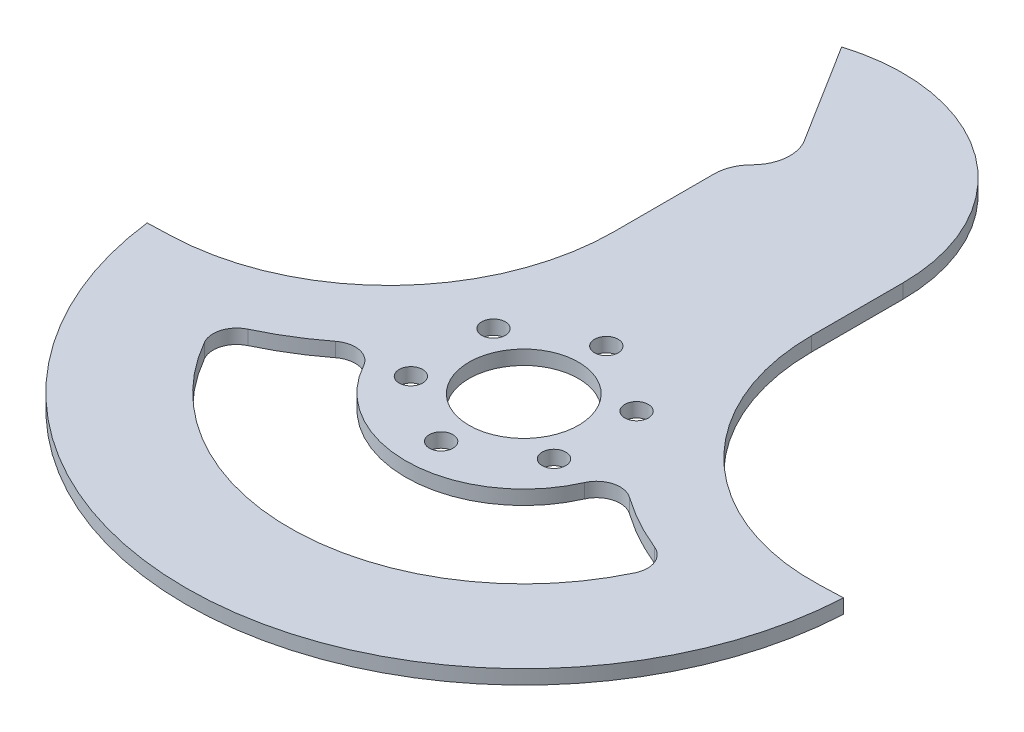
ISO-10303-21;
HEADER;
FILE_DESCRIPTION(('STEP AP214'),'2;1');
FILE_NAME('part.step','',(''),(''),'','','');
FILE_SCHEMA(('AUTOMOTIVE_DESIGN { 1 0 10303 214 1 1 1 1 }'));
ENDSEC;
DATA;
#1=APPLICATION_CONTEXT('core data for automotive mechanical design processes');
#2=APPLICATION_PROTOCOL_DEFINITION('international standard','automotive_design',2000,#1);
#3=PRODUCT_CONTEXT('',#1,'mechanical');
#4=PRODUCT('Part','Part','',(#3));
#5=PRODUCT_RELATED_PRODUCT_CATEGORY('part','',(#4));
#6=PRODUCT_DEFINITION_FORMATION('','',#4);
#7=PRODUCT_DEFINITION_CONTEXT('part definition',#1,'design');
#8=PRODUCT_DEFINITION('design','',#6,#7);
#9=PRODUCT_DEFINITION_SHAPE('','',#8);
#10=(LENGTH_UNIT() NAMED_UNIT(*) SI_UNIT(.MILLI.,.METRE.));
#11=(NAMED_UNIT(*) PLANE_ANGLE_UNIT() SI_UNIT($,.RADIAN.));
#12=(NAMED_UNIT(*) SI_UNIT($,.STERADIAN.) SOLID_ANGLE_UNIT());
#13=UNCERTAINTY_MEASURE_WITH_UNIT(LENGTH_MEASURE(1.E-05),#10,'distance_accuracy_value','');
#14=(GEOMETRIC_REPRESENTATION_CONTEXT(3) GLOBAL_UNCERTAINTY_ASSIGNED_CONTEXT((#13)) GLOBAL_UNIT_ASSIGNED_CONTEXT((#10,
#11,#12)) REPRESENTATION_CONTEXT('',''));
#15=CARTESIAN_POINT('',(0.,0.,0.));
#16=DIRECTION('',(0.,0.,1.));
#17=DIRECTION('',(1.,0.,0.));
#18=AXIS2_PLACEMENT_3D('',#15,#16,#17);
#19=CARTESIAN_POINT('',(-18.4988886877586,3.02,-60.3286115053032));
#20=DIRECTION('',(0.,-1.,0.));
#21=DIRECTION('',(0.,0.,-1.));
#22=AXIS2_PLACEMENT_3D('',#19,#20,#21);
#23=CYLINDRICAL_SURFACE('',#22,38.4988886877586);
#24=CARTESIAN_POINT('',(-18.4988886877586,0.,-60.3286115053032));
#25=DIRECTION('',(0.,1.,0.));
#26=DIRECTION('',(0.,0.,-1.));
#27=AXIS2_PLACEMENT_3D('',#24,#25,#26);
#28=CIRCLE('',#27,38.4988886877586);
#29=CARTESIAN_POINT('',(20.,0.,-60.3286115053032));
#30=VERTEX_POINT('',#29);
#31=CARTESIAN_POINT('',(-29.7853247207653,0.,-97.1359584874652));
#32=VERTEX_POINT('',#31);
#33=EDGE_CURVE('E189',#30,#32,#28,.T.);
#34=ORIENTED_EDGE('',*,*,#33,.T.);
#35=DIRECTION('',(0.,-1.,0.));
#36=VECTOR('',#35,1.);
#37=CARTESIAN_POINT('',(-29.7853247207653,3.02,-97.1359584874652));
#38=LINE('',#37,#36);
#39=CARTESIAN_POINT('',(-29.7853247207653,3.02,-97.1359584874652));
#40=VERTEX_POINT('',#39);
#41=EDGE_CURVE('E170',#40,#32,#38,.T.);
#42=ORIENTED_EDGE('',*,*,#41,.F.);
#43=CARTESIAN_POINT('',(-18.4988886877586,3.02,-60.3286115053032));
#44=DIRECTION('',(0.,1.,0.));
#45=DIRECTION('',(0.,0.,-1.));
#46=AXIS2_PLACEMENT_3D('',#43,#44,#45);
#47=CIRCLE('',#46,38.4988886877586);
#48=CARTESIAN_POINT('',(20.,3.02,-60.3286115053032));
#49=VERTEX_POINT('',#48);
#50=EDGE_CURVE('E177',#49,#40,#47,.T.);
#51=ORIENTED_EDGE('',*,*,#50,.F.);
#52=DIRECTION('',(0.,-1.,0.));
#53=VECTOR('',#52,1.);
#54=CARTESIAN_POINT('',(20.,3.02,-60.3286115053032));
#55=LINE('',#54,#53);
#56=EDGE_CURVE('E278',#49,#30,#55,.T.);
#57=ORIENTED_EDGE('',*,*,#56,.T.);
#58=EDGE_LOOP('',(#34,#42,#51,#57));
#59=FACE_BOUND('',#58,.T.);
#60=ADVANCED_FACE('F36',(#59),#23,.T.);
#61=CARTESIAN_POINT('',(-29.7853247207653,3.02,-97.1359584874652));
#62=DIRECTION('',(0.847609465178038,0.,-0.530620574931467));
#63=DIRECTION('',(-0.530620574931467,0.,-0.847609465178038));
#64=AXIS2_PLACEMENT_3D('',#61,#62,#63);
#65=PLANE('',#64);
#66=DIRECTION('',(0.530620574931467,0.,0.847609465178038));
#67=VECTOR('',#66,1.);
#68=CARTESIAN_POINT('',(-29.7853247207653,0.,-97.1359584874652));
#69=LINE('',#68,#67);
#70=CARTESIAN_POINT('',(-16.5198103474786,0.,-75.9457218580143));
#71=VERTEX_POINT('',#70);
#72=EDGE_CURVE('E280',#32,#71,#69,.T.);
#73=ORIENTED_EDGE('',*,*,#72,.T.);
#74=DIRECTION('',(0.,-1.,0.));
#75=VECTOR('',#74,1.);
#76=CARTESIAN_POINT('',(-16.5198103474786,3.02,-75.9457218580143));
#77=LINE('',#76,#75);
#78=CARTESIAN_POINT('',(-16.5198103474786,3.02,-75.9457218580143));
#79=VERTEX_POINT('',#78);
#80=EDGE_CURVE('E173',#79,#71,#77,.T.);
#81=ORIENTED_EDGE('',*,*,#80,.F.);
#82=DIRECTION('',(0.530620574931467,0.,0.847609465178038));
#83=VECTOR('',#82,1.);
#84=CARTESIAN_POINT('',(-29.7853247207653,3.02,-97.1359584874652));
#85=LINE('',#84,#83);
#86=EDGE_CURVE('E166',#40,#79,#85,.T.);
#87=ORIENTED_EDGE('',*,*,#86,.F.);
#88=ORIENTED_EDGE('',*,*,#41,.T.);
#89=EDGE_LOOP('',(#73,#81,#87,#88));
#90=FACE_BOUND('',#89,.T.);
#91=ADVANCED_FACE('F168',(#90),#65,.F.);
#92=CARTESIAN_POINT('',(-23.3261545491666,3.02,-71.684813477617));
#93=DIRECTION('',(0.,-1.,0.));
#94=DIRECTION('',(0.,0.,-1.));
#95=AXIS2_PLACEMENT_3D('',#92,#93,#94);
#96=CYLINDRICAL_SURFACE('',#95,8.03004742314711);
#97=CARTESIAN_POINT('',(-23.3261545491666,0.,-71.684813477617));
#98=DIRECTION('',(0.,-1.,0.));
#99=DIRECTION('',(0.,0.,-1.));
#100=AXIS2_PLACEMENT_3D('',#97,#98,#99);
#101=CIRCLE('',#100,8.03004742314711);
#102=CARTESIAN_POINT('',(-17.6480535630098,0.,-66.0067124914601));
#103=VERTEX_POINT('',#102);
#104=EDGE_CURVE('E282',#71,#103,#101,.T.);
#105=ORIENTED_EDGE('',*,*,#104,.T.);
#106=DIRECTION('',(0.,-1.,0.));
#107=VECTOR('',#106,1.);
#108=CARTESIAN_POINT('',(-17.6480535630098,3.02,-66.0067124914601));
#109=LINE('',#108,#107);
#110=CARTESIAN_POINT('',(-17.6480535630098,3.02,-66.0067124914601));
#111=VERTEX_POINT('',#110);
#112=EDGE_CURVE('E195',#111,#103,#109,.T.);
#113=ORIENTED_EDGE('',*,*,#112,.F.);
#114=CARTESIAN_POINT('',(-23.3261545491666,3.02,-71.684813477617));
#115=DIRECTION('',(0.,-1.,0.));
#116=DIRECTION('',(0.,0.,-1.));
#117=AXIS2_PLACEMENT_3D('',#114,#115,#116);
#118=CIRCLE('',#117,8.03004742314711);
#119=EDGE_CURVE('E176',#79,#111,#118,.T.);
#120=ORIENTED_EDGE('',*,*,#119,.F.);
#121=ORIENTED_EDGE('',*,*,#80,.T.);
#122=EDGE_LOOP('',(#105,#113,#120,#121));
#123=FACE_BOUND('',#122,.T.);
#124=ADVANCED_FACE('F344',(#123),#96,.F.);
#125=CARTESIAN_POINT('',(-11.9699525768529,3.02,-60.3286115053032));
#126=DIRECTION('',(0.,-1.,0.));
#127=DIRECTION('',(0.,0.,-1.));
#128=AXIS2_PLACEMENT_3D('',#125,#126,#127);
#129=CYLINDRICAL_SURFACE('',#128,8.03004742314711);
#130=CARTESIAN_POINT('',(-11.9699525768529,0.,-60.3286115053032));
#131=DIRECTION('',(0.,1.,0.));
#132=DIRECTION('',(0.,0.,1.));
#133=AXIS2_PLACEMENT_3D('',#130,#131,#132);
#134=CIRCLE('',#133,8.03004742314711);
#135=CARTESIAN_POINT('',(-20.,0.,-60.3286115053032));
#136=VERTEX_POINT('',#135);
#137=EDGE_CURVE('E284',#103,#136,#134,.T.);
#138=ORIENTED_EDGE('',*,*,#137,.T.);
#139=DIRECTION('',(0.,-1.,0.));
#140=VECTOR('',#139,1.);
#141=CARTESIAN_POINT('',(-20.,3.02,-60.3286115053032));
#142=LINE('',#141,#140);
#143=CARTESIAN_POINT('',(-20.,3.02,-60.3286115053032));
#144=VERTEX_POINT('',#143);
#145=EDGE_CURVE('E318',#144,#136,#142,.T.);
#146=ORIENTED_EDGE('',*,*,#145,.F.);
#147=CARTESIAN_POINT('',(-11.9699525768529,3.02,-60.3286115053032));
#148=DIRECTION('',(0.,1.,0.));
#149=DIRECTION('',(0.,0.,1.));
#150=AXIS2_PLACEMENT_3D('',#147,#148,#149);
#151=CIRCLE('',#150,8.03004742314711);
#152=EDGE_CURVE('E263',#111,#144,#151,.T.);
#153=ORIENTED_EDGE('',*,*,#152,.F.);
#154=ORIENTED_EDGE('',*,*,#112,.T.);
#155=EDGE_LOOP('',(#138,#146,#153,#154));
#156=FACE_BOUND('',#155,.T.);
#157=ADVANCED_FACE('F325',(#156),#129,.T.);
#158=CARTESIAN_POINT('',(-20.,3.02,-60.3286115053032));
#159=DIRECTION('',(1.,0.,0.));
#160=DIRECTION('',(0.,0.,-1.));
#161=AXIS2_PLACEMENT_3D('',#158,#159,#160);
#162=PLANE('',#161);
#163=DIRECTION('',(0.,0.,1.));
#164=VECTOR('',#163,1.);
#165=CARTESIAN_POINT('',(-20.,0.,-60.3286115053032));
#166=LINE('',#165,#164);
#167=CARTESIAN_POINT('',(-20.,0.,-39.1548612912108));
#168=VERTEX_POINT('',#167);
#169=EDGE_CURVE('E286',#136,#168,#166,.T.);
#170=ORIENTED_EDGE('',*,*,#169,.T.);
#171=DIRECTION('',(0.,-1.,0.));
#172=VECTOR('',#171,1.);
#173=CARTESIAN_POINT('',(-20.,3.02,-39.1548612912108));
#174=LINE('',#173,#172);
#175=CARTESIAN_POINT('',(-20.,3.02,-39.1548612912108));
#176=VERTEX_POINT('',#175);
#177=EDGE_CURVE('E315',#176,#168,#174,.T.);
#178=ORIENTED_EDGE('',*,*,#177,.F.);
#179=DIRECTION('',(0.,0.,1.));
#180=VECTOR('',#179,1.);
#181=CARTESIAN_POINT('',(-20.,3.02,-60.3286115053032));
#182=LINE('',#181,#180);
#183=EDGE_CURVE('E265',#144,#176,#182,.T.);
#184=ORIENTED_EDGE('',*,*,#183,.F.);
#185=ORIENTED_EDGE('',*,*,#145,.T.);
#186=EDGE_LOOP('',(#170,#178,#184,#185));
#187=FACE_BOUND('',#186,.T.);
#188=ADVANCED_FACE('F336',(#187),#162,.F.);
#189=CARTESIAN_POINT('',(-67.7352878430961,3.02,-39.1548612912108));
#190=DIRECTION('',(0.,-1.,0.));
#191=DIRECTION('',(0.,0.,-1.));
#192=AXIS2_PLACEMENT_3D('',#189,#190,#191);
#193=CYLINDRICAL_SURFACE('',#192,47.7352878430961);
#194=CARTESIAN_POINT('',(-67.7352878430961,0.,-39.1548612912108));
#195=DIRECTION('',(0.,-1.,0.));
#196=DIRECTION('',(0.,0.,1.));
#197=AXIS2_PLACEMENT_3D('',#194,#195,#196);
#198=CIRCLE('',#197,47.7352878430961);
#199=CARTESIAN_POINT('',(-66.0693503224232,0.,8.5513475042956));
#200=VERTEX_POINT('',#199);
#201=EDGE_CURVE('E288',#168,#200,#198,.T.);
#202=ORIENTED_EDGE('',*,*,#201,.T.);
#203=DIRECTION('',(0.,-1.,0.));
#204=VECTOR('',#203,1.);
#205=CARTESIAN_POINT('',(-66.0693503224232,3.02,8.5513475042956));
#206=LINE('',#205,#204);
#207=CARTESIAN_POINT('',(-66.0693503224232,3.02,8.5513475042956));
#208=VERTEX_POINT('',#207);
#209=EDGE_CURVE('E312',#208,#200,#206,.T.);
#210=ORIENTED_EDGE('',*,*,#209,.F.);
#211=CARTESIAN_POINT('',(-67.7352878430961,3.02,-39.1548612912108));
#212=DIRECTION('',(0.,-1.,0.));
#213=DIRECTION('',(0.,0.,1.));
#214=AXIS2_PLACEMENT_3D('',#211,#212,#213);
#215=CIRCLE('',#214,47.7352878430961);
#216=EDGE_CURVE('E267',#176,#208,#215,.T.);
#217=ORIENTED_EDGE('',*,*,#216,.F.);
#218=ORIENTED_EDGE('',*,*,#177,.T.);
#219=EDGE_LOOP('',(#202,#210,#217,#218));
#220=FACE_BOUND('',#219,.T.);
#221=ADVANCED_FACE('F340',(#220),#193,.F.);
#222=CARTESIAN_POINT('',(-71.0663044575187,3.02,8.72584498780808));
#223=DIRECTION('',(0.0348994967024969,0.,0.999390827019096));
#224=DIRECTION('',(0.999390827019096,0.,-0.0348994967024969));
#225=AXIS2_PLACEMENT_3D('',#222,#223,#224);
#226=PLANE('',#225);
#227=DIRECTION('',(-0.999390827019096,0.,0.0348994967024969));
#228=VECTOR('',#227,1.);
#229=CARTESIAN_POINT('',(-71.0663044575187,0.,8.72584498780808));
#230=LINE('',#229,#228);
#231=CARTESIAN_POINT('',(-71.0663044575187,0.,8.72584498780808));
#232=VERTEX_POINT('',#231);
#233=EDGE_CURVE('E290',#200,#232,#230,.T.);
#234=ORIENTED_EDGE('',*,*,#233,.T.);
#235=DIRECTION('',(0.,-1.,0.));
#236=VECTOR('',#235,1.);
#237=CARTESIAN_POINT('',(-71.0663044575187,3.02,8.72584498780808));
#238=LINE('',#237,#236);
#239=CARTESIAN_POINT('',(-71.0663044575187,3.02,8.72584498780808));
#240=VERTEX_POINT('',#239);
#241=EDGE_CURVE('E309',#240,#232,#238,.T.);
#242=ORIENTED_EDGE('',*,*,#241,.F.);
#243=DIRECTION('',(-0.999390827019096,0.,0.0348994967024969));
#244=VECTOR('',#243,1.);
#245=CARTESIAN_POINT('',(-71.0663044575187,3.02,8.72584498780808));
#246=LINE('',#245,#244);
#247=EDGE_CURVE('E269',#208,#240,#246,.T.);
#248=ORIENTED_EDGE('',*,*,#247,.F.);
#249=ORIENTED_EDGE('',*,*,#209,.T.);
#250=EDGE_LOOP('',(#234,#242,#248,#249));
#251=FACE_BOUND('',#250,.T.);
#252=ADVANCED_FACE('F415',(#251),#226,.F.);
#253=CARTESIAN_POINT('',(0.,3.02,0.));
#254=DIRECTION('',(0.,-1.,0.));
#255=DIRECTION('',(0.,0.,-1.));
#256=AXIS2_PLACEMENT_3D('',#253,#254,#255);
#257=CYLINDRICAL_SURFACE('',#256,71.6);
#258=CARTESIAN_POINT('',(0.,0.,0.));
#259=DIRECTION('',(0.,1.,0.));
#260=DIRECTION('',(0.,0.,1.));
#261=AXIS2_PLACEMENT_3D('',#258,#259,#260);
#262=CIRCLE('',#261,71.6);
#263=CARTESIAN_POINT('',(71.5018746884275,0.,3.74725446699478));
#264=VERTEX_POINT('',#263);
#265=EDGE_CURVE('E292',#232,#264,#262,.T.);
#266=ORIENTED_EDGE('',*,*,#265,.T.);
#267=DIRECTION('',(0.,-1.,0.));
#268=VECTOR('',#267,1.);
#269=CARTESIAN_POINT('',(71.5018746884275,3.02,3.74725446699478));
#270=LINE('',#269,#268);
#271=CARTESIAN_POINT('',(71.5018746884275,3.02,3.74725446699478));
#272=VERTEX_POINT('',#271);
#273=EDGE_CURVE('E306',#272,#264,#270,.T.);
#274=ORIENTED_EDGE('',*,*,#273,.F.);
#275=CARTESIAN_POINT('',(0.,3.02,0.));
#276=DIRECTION('',(0.,1.,0.));
#277=DIRECTION('',(0.,0.,1.));
#278=AXIS2_PLACEMENT_3D('',#275,#276,#277);
#279=CIRCLE('',#278,71.6);
#280=EDGE_CURVE('E271',#240,#272,#279,.T.);
#281=ORIENTED_EDGE('',*,*,#280,.F.);
#282=ORIENTED_EDGE('',*,*,#241,.T.);
#283=EDGE_LOOP('',(#266,#274,#281,#282));
#284=FACE_BOUND('',#283,.T.);
#285=ADVANCED_FACE('F411',(#284),#257,.T.);
#286=CARTESIAN_POINT('',(71.5018746884275,3.02,3.74725446699479));
#287=DIRECTION('',(0.0348994967024994,0.,0.999390827019096));
#288=DIRECTION('',(0.999390827019096,0.,-0.0348994967024994));
#289=AXIS2_PLACEMENT_3D('',#286,#287,#288);
#290=PLANE('',#289);
#291=DIRECTION('',(-0.999390827019096,0.,0.0348994967024994));
#292=VECTOR('',#291,1.);
#293=CARTESIAN_POINT('',(71.5018746884275,0.,3.74725446699479));
#294=LINE('',#293,#292);
#295=CARTESIAN_POINT('',(66.504920553332,0.,3.92175195050728));
#296=VERTEX_POINT('',#295);
#297=EDGE_CURVE('E294',#264,#296,#294,.T.);
#298=ORIENTED_EDGE('',*,*,#297,.T.);
#299=DIRECTION('',(0.,-1.,0.));
#300=VECTOR('',#299,1.);
#301=CARTESIAN_POINT('',(66.504920553332,3.02,3.92175195050728));
#302=LINE('',#301,#300);
#303=CARTESIAN_POINT('',(66.504920553332,3.02,3.92175195050728));
#304=VERTEX_POINT('',#303);
#305=EDGE_CURVE('E303',#304,#296,#302,.T.);
#306=ORIENTED_EDGE('',*,*,#305,.F.);
#307=DIRECTION('',(-0.999390827019096,0.,0.0348994967024994));
#308=VECTOR('',#307,1.);
#309=CARTESIAN_POINT('',(71.5018746884275,3.02,3.74725446699479));
#310=LINE('',#309,#308);
#311=EDGE_CURVE('E273',#272,#304,#310,.T.);
#312=ORIENTED_EDGE('',*,*,#311,.F.);
#313=ORIENTED_EDGE('',*,*,#273,.T.);
#314=EDGE_LOOP('',(#298,#306,#312,#313));
#315=FACE_BOUND('',#314,.T.);
#316=ADVANCED_FACE('F407',(#315),#290,.F.);
#317=CARTESIAN_POINT('',(64.9366539470845,3.02,-40.9875278011404));
#318=DIRECTION('',(0.,-1.,0.));
#319=DIRECTION('',(0.,0.,-1.));
#320=AXIS2_PLACEMENT_3D('',#317,#318,#319);
#321=CYLINDRICAL_SURFACE('',#320,44.9366539470845);
#322=CARTESIAN_POINT('',(64.9366539470845,0.,-40.9875278011404));
#323=DIRECTION('',(0.,-1.,0.));
#324=DIRECTION('',(0.,0.,1.));
#325=AXIS2_PLACEMENT_3D('',#322,#323,#324);
#326=CIRCLE('',#325,44.9366539470845);
#327=CARTESIAN_POINT('',(20.,0.,-40.9875278011404));
#328=VERTEX_POINT('',#327);
#329=EDGE_CURVE('E296',#296,#328,#326,.T.);
#330=ORIENTED_EDGE('',*,*,#329,.T.);
#331=DIRECTION('',(0.,-1.,0.));
#332=VECTOR('',#331,1.);
#333=CARTESIAN_POINT('',(20.,3.02,-40.9875278011404));
#334=LINE('',#333,#332);
#335=CARTESIAN_POINT('',(20.,3.02,-40.9875278011404));
#336=VERTEX_POINT('',#335);
#337=EDGE_CURVE('E300',#336,#328,#334,.T.);
#338=ORIENTED_EDGE('',*,*,#337,.F.);
#339=CARTESIAN_POINT('',(64.9366539470845,3.02,-40.9875278011404));
#340=DIRECTION('',(0.,-1.,0.));
#341=DIRECTION('',(0.,0.,1.));
#342=AXIS2_PLACEMENT_3D('',#339,#340,#341);
#343=CIRCLE('',#342,44.9366539470845);
#344=EDGE_CURVE('E275',#304,#336,#343,.T.);
#345=ORIENTED_EDGE('',*,*,#344,.F.);
#346=ORIENTED_EDGE('',*,*,#305,.T.);
#347=EDGE_LOOP('',(#330,#338,#345,#346));
#348=FACE_BOUND('',#347,.T.);
#349=ADVANCED_FACE('F403',(#348),#321,.F.);
#350=CARTESIAN_POINT('',(20.,3.02,-60.3286115053032));
#351=DIRECTION('',(-1.,0.,0.));
#352=DIRECTION('',(0.,0.,1.));
#353=AXIS2_PLACEMENT_3D('',#350,#351,#352);
#354=PLANE('',#353);
#355=DIRECTION('',(0.,0.,-1.));
#356=VECTOR('',#355,1.);
#357=CARTESIAN_POINT('',(20.,0.,-60.3286115053032));
#358=LINE('',#357,#356);
#359=EDGE_CURVE('E186',#328,#30,#358,.T.);
#360=ORIENTED_EDGE('',*,*,#359,.T.);
#361=ORIENTED_EDGE('',*,*,#56,.F.);
#362=DIRECTION('',(0.,0.,-1.));
#363=VECTOR('',#362,1.);
#364=CARTESIAN_POINT('',(20.,3.02,-60.3286115053032));
#365=LINE('',#364,#363);
#366=EDGE_CURVE('E182',#336,#49,#365,.T.);
#367=ORIENTED_EDGE('',*,*,#366,.F.);
#368=ORIENTED_EDGE('',*,*,#337,.T.);
#369=EDGE_LOOP('',(#360,#361,#367,#368));
#370=FACE_BOUND('',#369,.T.);
#371=ADVANCED_FACE('F395',(#370),#354,.F.);
#372=CARTESIAN_POINT('',(-18.4988886877586,3.02,-60.3286115053032));
#373=DIRECTION('',(0.,-1.,0.));
#374=DIRECTION('',(0.,0.,-1.));
#375=AXIS2_PLACEMENT_3D('',#372,#373,#374);
#376=PLANE('',#375);
#377=CARTESIAN_POINT('',(0.168160546794866,3.02,17.6725596259594));
#378=DIRECTION('',(0.,1.,0.));
#379=DIRECTION('',(0.,0.,1.));
#380=AXIS2_PLACEMENT_3D('',#377,#378,#379);
#381=CIRCLE('',#380,2.5);
#382=CARTESIAN_POINT('',(0.168160546794866,3.02,20.1725596259594));
#383=VERTEX_POINT('',#382);
#384=EDGE_CURVE('E632',#383,#383,#381,.T.);
#385=ORIENTED_EDGE('',*,*,#384,.F.);
#386=EDGE_LOOP('',(#385));
#387=FACE_BOUND('',#386,.T.);
#388=CARTESIAN_POINT('',(15.3236051130226,3.02,8.92255962595941));
#389=DIRECTION('',(0.,1.,0.));
#390=DIRECTION('',(0.,0.,1.));
#391=AXIS2_PLACEMENT_3D('',#388,#389,#390);
#392=CIRCLE('',#391,2.5);
#393=CARTESIAN_POINT('',(15.3236051130226,3.02,11.4225596259594));
#394=VERTEX_POINT('',#393);
#395=EDGE_CURVE('E660',#394,#394,#392,.T.);
#396=ORIENTED_EDGE('',*,*,#395,.F.);
#397=EDGE_LOOP('',(#396));
#398=FACE_BOUND('',#397,.T.);
#399=CARTESIAN_POINT('',(15.3236051130225,3.02,-8.57744037404059));
#400=DIRECTION('',(0.,1.,0.));
#401=DIRECTION('',(0.,0.,1.));
#402=AXIS2_PLACEMENT_3D('',#399,#400,#401);
#403=CIRCLE('',#402,2.5);
#404=CARTESIAN_POINT('',(15.3236051130225,3.02,-6.07744037404058));
#405=VERTEX_POINT('',#404);
#406=EDGE_CURVE('E635',#405,#405,#403,.T.);
#407=ORIENTED_EDGE('',*,*,#406,.F.);
#408=EDGE_LOOP('',(#407));
#409=FACE_BOUND('',#408,.T.);
#410=CARTESIAN_POINT('',(0.168160546794866,3.02,-17.3274403740406));
#411=DIRECTION('',(0.,1.,0.));
#412=DIRECTION('',(0.,0.,1.));
#413=AXIS2_PLACEMENT_3D('',#410,#411,#412);
#414=CIRCLE('',#413,2.5);
#415=CARTESIAN_POINT('',(0.168160546794866,3.02,-14.8274403740406));
#416=VERTEX_POINT('',#415);
#417=EDGE_CURVE('E642',#416,#416,#414,.T.);
#418=ORIENTED_EDGE('',*,*,#417,.F.);
#419=EDGE_LOOP('',(#418));
#420=FACE_BOUND('',#419,.T.);
#421=CARTESIAN_POINT('',(-14.9872840194328,3.02,-8.57744037404058));
#422=DIRECTION('',(0.,1.,0.));
#423=DIRECTION('',(0.,0.,1.));
#424=AXIS2_PLACEMENT_3D('',#421,#422,#423);
#425=CIRCLE('',#424,2.5);
#426=CARTESIAN_POINT('',(-14.9872840194328,3.02,-6.07744037404057));
#427=VERTEX_POINT('',#426);
#428=EDGE_CURVE('E648',#427,#427,#425,.T.);
#429=ORIENTED_EDGE('',*,*,#428,.F.);
#430=EDGE_LOOP('',(#429));
#431=FACE_BOUND('',#430,.T.);
#432=CARTESIAN_POINT('',(-14.9872840194328,3.02,8.92255962595942));
#433=DIRECTION('',(0.,1.,0.));
#434=DIRECTION('',(0.,0.,1.));
#435=AXIS2_PLACEMENT_3D('',#432,#433,#434);
#436=CIRCLE('',#435,2.5);
#437=CARTESIAN_POINT('',(-14.9872840194328,3.02,11.4225596259594));
#438=VERTEX_POINT('',#437);
#439=EDGE_CURVE('E654',#438,#438,#436,.T.);
#440=ORIENTED_EDGE('',*,*,#439,.F.);
#441=EDGE_LOOP('',(#440));
#442=FACE_BOUND('',#441,.T.);
#443=CARTESIAN_POINT('',(0.168160546794866,3.02,0.172559625959421));
#444=DIRECTION('',(0.,1.,0.));
#445=DIRECTION('',(0.,0.,1.));
#446=AXIS2_PLACEMENT_3D('',#443,#444,#445);
#447=CIRCLE('',#446,11.6);
#448=CARTESIAN_POINT('',(0.168160546794866,3.02,11.7725596259594));
#449=VERTEX_POINT('',#448);
#450=EDGE_CURVE('E627',#449,#449,#447,.T.);
#451=ORIENTED_EDGE('',*,*,#450,.F.);
#452=EDGE_LOOP('',(#451));
#453=FACE_BOUND('',#452,.T.);
#454=CARTESIAN_POINT('',(-67.7352878430961,3.02,-39.1548612912108));
#455=DIRECTION('',(0.,-1.,0.));
#456=DIRECTION('',(0.,0.,-1.));
#457=AXIS2_PLACEMENT_3D('',#454,#455,#456);
#458=CIRCLE('',#457,62.7352878430961);
#459=CARTESIAN_POINT('',(-29.360174511927,3.02,10.4744346697037));
#460=VERTEX_POINT('',#459);
#461=CARTESIAN_POINT('',(-40.8963295212605,3.02,17.5495182306118));
#462=VERTEX_POINT('',#461);
#463=EDGE_CURVE('E233',#460,#462,#458,.T.);
#464=ORIENTED_EDGE('',*,*,#463,.F.);
#465=CARTESIAN_POINT('',(-26.3016794726481,3.02,14.4298876266615));
#466=DIRECTION('',(0.,-1.,0.));
#467=DIRECTION('',(0.,0.,-1.));
#468=AXIS2_PLACEMENT_3D('',#465,#466,#467);
#469=CIRCLE('',#468,5.);
#470=CARTESIAN_POINT('',(-21.9180662272067,3.02,12.0249063555513));
#471=VERTEX_POINT('',#470);
#472=EDGE_CURVE('E44',#460,#471,#469,.T.);
#473=ORIENTED_EDGE('',*,*,#472,.T.);
#474=CARTESIAN_POINT('',(0.,3.02,0.));
#475=DIRECTION('',(0.,1.,0.));
#476=DIRECTION('',(0.,0.,1.));
#477=AXIS2_PLACEMENT_3D('',#474,#475,#476);
#478=CIRCLE('',#477,25.);
#479=CARTESIAN_POINT('',(22.89383918866,3.02,10.0435116968007));
#480=VERTEX_POINT('',#479);
#481=EDGE_CURVE('E231',#471,#480,#478,.T.);
#482=ORIENTED_EDGE('',*,*,#481,.T.);
#483=CARTESIAN_POINT('',(27.472607026392,3.02,12.0522140361608));
#484=DIRECTION('',(0.,-1.,0.));
#485=DIRECTION('',(0.,0.,-1.));
#486=AXIS2_PLACEMENT_3D('',#483,#484,#485);
#487=CIRCLE('',#486,5.);
#488=CARTESIAN_POINT('',(30.3572680493654,3.02,7.96825385240064));
#489=VERTEX_POINT('',#488);
#490=EDGE_CURVE('E226',#480,#489,#487,.T.);
#491=ORIENTED_EDGE('',*,*,#490,.T.);
#492=CARTESIAN_POINT('',(64.9366539470845,3.02,-40.9875278011404));
#493=DIRECTION('',(0.,-1.,0.));
#494=DIRECTION('',(0.,0.,1.));
#495=AXIS2_PLACEMENT_3D('',#492,#493,#494);
#496=CIRCLE('',#495,59.9366539470845);
#497=CARTESIAN_POINT('',(42.2016225398616,3.02,14.4698507276465));
#498=VERTEX_POINT('',#497);
#499=EDGE_CURVE('E247',#498,#489,#496,.T.);
#500=ORIENTED_EDGE('',*,*,#499,.F.);
#501=CARTESIAN_POINT('',(40.3050342328722,3.02,19.0961832701461));
#502=DIRECTION('',(0.,-1.,0.));
#503=DIRECTION('',(0.,0.,-1.));
#504=AXIS2_PLACEMENT_3D('',#501,#502,#503);
#505=CIRCLE('',#504,5.);
#506=CARTESIAN_POINT('',(44.8235358284856,3.02,21.2370109910145));
#507=VERTEX_POINT('',#506);
#508=EDGE_CURVE('E206',#498,#507,#505,.T.);
#509=ORIENTED_EDGE('',*,*,#508,.T.);
#510=CARTESIAN_POINT('',(0.,3.02,0.));
#511=DIRECTION('',(0.,1.,0.));
#512=DIRECTION('',(0.,0.,1.));
#513=AXIS2_PLACEMENT_3D('',#510,#511,#512);
#514=CIRCLE('',#513,49.6000000000001);
#515=CARTESIAN_POINT('',(-43.1022505186581,3.02,24.5429419635634));
#516=VERTEX_POINT('',#515);
#517=EDGE_CURVE('E253',#516,#507,#514,.T.);
#518=ORIENTED_EDGE('',*,*,#517,.F.);
#519=CARTESIAN_POINT('',(-38.7572655873418,3.02,22.0688550720751));
#520=DIRECTION('',(0.,-1.,0.));
#521=DIRECTION('',(0.,0.,-1.));
#522=AXIS2_PLACEMENT_3D('',#519,#520,#521);
#523=CIRCLE('',#522,5.);
#524=EDGE_CURVE('E210',#516,#462,#523,.T.);
#525=ORIENTED_EDGE('',*,*,#524,.T.);
#526=EDGE_LOOP('',(#464,#473,#482,#491,#500,#509,#518,#525));
#527=FACE_BOUND('',#526,.T.);
#528=ORIENTED_EDGE('',*,*,#50,.T.);
#529=ORIENTED_EDGE('',*,*,#86,.T.);
#530=ORIENTED_EDGE('',*,*,#119,.T.);
#531=ORIENTED_EDGE('',*,*,#152,.T.);
#532=ORIENTED_EDGE('',*,*,#183,.T.);
#533=ORIENTED_EDGE('',*,*,#216,.T.);
#534=ORIENTED_EDGE('',*,*,#247,.T.);
#535=ORIENTED_EDGE('',*,*,#280,.T.);
#536=ORIENTED_EDGE('',*,*,#311,.T.);
#537=ORIENTED_EDGE('',*,*,#344,.T.);
#538=ORIENTED_EDGE('',*,*,#366,.T.);
#539=EDGE_LOOP('',(#528,#529,#530,#531,#532,#533,#534,#535,#536,#537,#538));
#540=FACE_BOUND('',#539,.T.);
#541=ADVANCED_FACE('F180',(#387,#398,#409,#420,#431,#442,#453,#527,#540),#376,.F.);
#542=CARTESIAN_POINT('',(-18.4988886877586,0.,-60.3286115053032));
#543=DIRECTION('',(0.,-1.,0.));
#544=DIRECTION('',(0.,0.,-1.));
#545=AXIS2_PLACEMENT_3D('',#542,#543,#544);
#546=PLANE('',#545);
#547=CARTESIAN_POINT('',(0.168160546794866,0.,17.6725596259594));
#548=DIRECTION('',(0.,1.,0.));
#549=DIRECTION('',(0.,0.,1.));
#550=AXIS2_PLACEMENT_3D('',#547,#548,#549);
#551=CIRCLE('',#550,2.5);
#552=CARTESIAN_POINT('',(0.168160546794866,0.,20.1725596259594));
#553=VERTEX_POINT('',#552);
#554=EDGE_CURVE('E629',#553,#553,#551,.T.);
#555=ORIENTED_EDGE('',*,*,#554,.T.);
#556=EDGE_LOOP('',(#555));
#557=FACE_BOUND('',#556,.T.);
#558=CARTESIAN_POINT('',(15.3236051130226,0.,8.92255962595941));
#559=DIRECTION('',(0.,1.,0.));
#560=DIRECTION('',(0.,0.,1.));
#561=AXIS2_PLACEMENT_3D('',#558,#559,#560);
#562=CIRCLE('',#561,2.5);
#563=CARTESIAN_POINT('',(15.3236051130226,0.,11.4225596259594));
#564=VERTEX_POINT('',#563);
#565=EDGE_CURVE('E639',#564,#564,#562,.T.);
#566=ORIENTED_EDGE('',*,*,#565,.T.);
#567=EDGE_LOOP('',(#566));
#568=FACE_BOUND('',#567,.T.);
#569=CARTESIAN_POINT('',(15.3236051130225,0.,-8.57744037404059));
#570=DIRECTION('',(0.,1.,0.));
#571=DIRECTION('',(0.,0.,1.));
#572=AXIS2_PLACEMENT_3D('',#569,#570,#571);
#573=CIRCLE('',#572,2.5);
#574=CARTESIAN_POINT('',(15.3236051130225,0.,-6.07744037404058));
#575=VERTEX_POINT('',#574);
#576=EDGE_CURVE('E638',#575,#575,#573,.T.);
#577=ORIENTED_EDGE('',*,*,#576,.T.);
#578=EDGE_LOOP('',(#577));
#579=FACE_BOUND('',#578,.T.);
#580=CARTESIAN_POINT('',(0.168160546794866,0.,-17.3274403740406));
#581=DIRECTION('',(0.,1.,0.));
#582=DIRECTION('',(0.,0.,1.));
#583=AXIS2_PLACEMENT_3D('',#580,#581,#582);
#584=CIRCLE('',#583,2.5);
#585=CARTESIAN_POINT('',(0.168160546794866,0.,-14.8274403740406));
#586=VERTEX_POINT('',#585);
#587=EDGE_CURVE('E645',#586,#586,#584,.T.);
#588=ORIENTED_EDGE('',*,*,#587,.T.);
#589=EDGE_LOOP('',(#588));
#590=FACE_BOUND('',#589,.T.);
#591=CARTESIAN_POINT('',(-14.9872840194328,0.,-8.57744037404058));
#592=DIRECTION('',(0.,1.,0.));
#593=DIRECTION('',(0.,0.,1.));
#594=AXIS2_PLACEMENT_3D('',#591,#592,#593);
#595=CIRCLE('',#594,2.5);
#596=CARTESIAN_POINT('',(-14.9872840194328,0.,-6.07744037404057));
#597=VERTEX_POINT('',#596);
#598=EDGE_CURVE('E651',#597,#597,#595,.T.);
#599=ORIENTED_EDGE('',*,*,#598,.T.);
#600=EDGE_LOOP('',(#599));
#601=FACE_BOUND('',#600,.T.);
#602=CARTESIAN_POINT('',(-14.9872840194328,0.,8.92255962595942));
#603=DIRECTION('',(0.,1.,0.));
#604=DIRECTION('',(0.,0.,1.));
#605=AXIS2_PLACEMENT_3D('',#602,#603,#604);
#606=CIRCLE('',#605,2.5);
#607=CARTESIAN_POINT('',(-14.9872840194328,0.,11.4225596259594));
#608=VERTEX_POINT('',#607);
#609=EDGE_CURVE('E657',#608,#608,#606,.T.);
#610=ORIENTED_EDGE('',*,*,#609,.T.);
#611=EDGE_LOOP('',(#610));
#612=FACE_BOUND('',#611,.T.);
#613=CARTESIAN_POINT('',(0.168160546794866,0.,0.172559625959421));
#614=DIRECTION('',(0.,1.,0.));
#615=DIRECTION('',(0.,0.,1.));
#616=AXIS2_PLACEMENT_3D('',#613,#614,#615);
#617=CIRCLE('',#616,11.6);
#618=CARTESIAN_POINT('',(0.168160546794866,0.,11.7725596259594));
#619=VERTEX_POINT('',#618);
#620=EDGE_CURVE('E239',#619,#619,#617,.T.);
#621=ORIENTED_EDGE('',*,*,#620,.T.);
#622=EDGE_LOOP('',(#621));
#623=FACE_BOUND('',#622,.T.);
#624=CARTESIAN_POINT('',(64.9366539470845,0.,-40.9875278011404));
#625=DIRECTION('',(0.,-1.,0.));
#626=DIRECTION('',(0.,0.,1.));
#627=AXIS2_PLACEMENT_3D('',#624,#625,#626);
#628=CIRCLE('',#627,59.9366539470845);
#629=CARTESIAN_POINT('',(42.2016225398616,0.,14.4698507276465));
#630=VERTEX_POINT('',#629);
#631=CARTESIAN_POINT('',(30.3572680493654,0.,7.96825385240064));
#632=VERTEX_POINT('',#631);
#633=EDGE_CURVE('E250',#630,#632,#628,.T.);
#634=ORIENTED_EDGE('',*,*,#633,.T.);
#635=CARTESIAN_POINT('',(27.472607026392,0.,12.0522140361608));
#636=DIRECTION('',(0.,-1.,0.));
#637=DIRECTION('',(0.,0.,-1.));
#638=AXIS2_PLACEMENT_3D('',#635,#636,#637);
#639=CIRCLE('',#638,5.);
#640=CARTESIAN_POINT('',(22.89383918866,0.,10.0435116968007));
#641=VERTEX_POINT('',#640);
#642=EDGE_CURVE('E224',#632,#641,#639,.F.);
#643=ORIENTED_EDGE('',*,*,#642,.T.);
#644=CARTESIAN_POINT('',(0.,0.,0.));
#645=DIRECTION('',(0.,-1.,0.));
#646=DIRECTION('',(0.,0.,-1.));
#647=AXIS2_PLACEMENT_3D('',#644,#645,#646);
#648=CIRCLE('',#647,25.);
#649=CARTESIAN_POINT('',(-21.9180662272067,0.,12.0249063555513));
#650=VERTEX_POINT('',#649);
#651=EDGE_CURVE('E238',#650,#641,#648,.F.);
#652=ORIENTED_EDGE('',*,*,#651,.F.);
#653=CARTESIAN_POINT('',(-26.3016794726481,0.,14.4298876266615));
#654=DIRECTION('',(0.,-1.,0.));
#655=DIRECTION('',(0.,0.,-1.));
#656=AXIS2_PLACEMENT_3D('',#653,#654,#655);
#657=CIRCLE('',#656,5.);
#658=CARTESIAN_POINT('',(-29.360174511927,0.,10.4744346697037));
#659=VERTEX_POINT('',#658);
#660=EDGE_CURVE('E11',#650,#659,#657,.F.);
#661=ORIENTED_EDGE('',*,*,#660,.T.);
#662=CARTESIAN_POINT('',(-67.7352878430961,0.,-39.1548612912108));
#663=DIRECTION('',(0.,-1.,0.));
#664=DIRECTION('',(0.,0.,-1.));
#665=AXIS2_PLACEMENT_3D('',#662,#663,#664);
#666=CIRCLE('',#665,62.7352878430961);
#667=CARTESIAN_POINT('',(-40.8963295212605,0.,17.5495182306118));
#668=VERTEX_POINT('',#667);
#669=EDGE_CURVE('E243',#659,#668,#666,.T.);
#670=ORIENTED_EDGE('',*,*,#669,.T.);
#671=CARTESIAN_POINT('',(-38.7572655873418,0.,22.0688550720751));
#672=DIRECTION('',(0.,-1.,0.));
#673=DIRECTION('',(0.,0.,-1.));
#674=AXIS2_PLACEMENT_3D('',#671,#672,#673);
#675=CIRCLE('',#674,5.);
#676=CARTESIAN_POINT('',(-43.1022505186581,0.,24.5429419635634));
#677=VERTEX_POINT('',#676);
#678=EDGE_CURVE('E213',#668,#677,#675,.F.);
#679=ORIENTED_EDGE('',*,*,#678,.T.);
#680=CARTESIAN_POINT('',(0.,0.,0.));
#681=DIRECTION('',(0.,1.,0.));
#682=DIRECTION('',(0.,0.,1.));
#683=AXIS2_PLACEMENT_3D('',#680,#681,#682);
#684=CIRCLE('',#683,49.6000000000001);
#685=CARTESIAN_POINT('',(44.8235358284856,0.,21.2370109910145));
#686=VERTEX_POINT('',#685);
#687=EDGE_CURVE('E246',#677,#686,#684,.T.);
#688=ORIENTED_EDGE('',*,*,#687,.T.);
#689=CARTESIAN_POINT('',(40.3050342328722,0.,19.0961832701461));
#690=DIRECTION('',(0.,-1.,0.));
#691=DIRECTION('',(0.,0.,-1.));
#692=AXIS2_PLACEMENT_3D('',#689,#690,#691);
#693=CIRCLE('',#692,5.);
#694=EDGE_CURVE('E208',#686,#630,#693,.F.);
#695=ORIENTED_EDGE('',*,*,#694,.T.);
#696=EDGE_LOOP('',(#634,#643,#652,#661,#670,#679,#688,#695));
#697=FACE_BOUND('',#696,.T.);
#698=ORIENTED_EDGE('',*,*,#33,.F.);
#699=ORIENTED_EDGE('',*,*,#359,.F.);
#700=ORIENTED_EDGE('',*,*,#329,.F.);
#701=ORIENTED_EDGE('',*,*,#297,.F.);
#702=ORIENTED_EDGE('',*,*,#265,.F.);
#703=ORIENTED_EDGE('',*,*,#233,.F.);
#704=ORIENTED_EDGE('',*,*,#201,.F.);
#705=ORIENTED_EDGE('',*,*,#169,.F.);
#706=ORIENTED_EDGE('',*,*,#137,.F.);
#707=ORIENTED_EDGE('',*,*,#104,.F.);
#708=ORIENTED_EDGE('',*,*,#72,.F.);
#709=EDGE_LOOP('',(#698,#699,#700,#701,#702,#703,#704,#705,#706,#707,#708));
#710=FACE_BOUND('',#709,.T.);
#711=ADVANCED_FACE('F331',(#557,#568,#579,#590,#601,#612,#623,#697,#710),#546,.T.);
#712=CARTESIAN_POINT('',(-67.7352878430961,0.,-39.1548612912108));
#713=DIRECTION('',(0.,1.,0.));
#714=DIRECTION('',(0.,0.,1.));
#715=AXIS2_PLACEMENT_3D('',#712,#713,#714);
#716=CYLINDRICAL_SURFACE('',#715,62.7352878430961);
#717=ORIENTED_EDGE('',*,*,#669,.F.);
#718=DIRECTION('',(0.,1.,0.));
#719=VECTOR('',#718,1.);
#720=CARTESIAN_POINT('',(-29.360174511927,0.,10.4744346697037));
#721=LINE('',#720,#719);
#722=EDGE_CURVE('E222',#659,#460,#721,.T.);
#723=ORIENTED_EDGE('',*,*,#722,.T.);
#724=ORIENTED_EDGE('',*,*,#463,.T.);
#725=DIRECTION('',(0.,1.,0.));
#726=VECTOR('',#725,1.);
#727=CARTESIAN_POINT('',(-40.8963295212605,0.,17.5495182306118));
#728=LINE('',#727,#726);
#729=EDGE_CURVE('E203',#462,#668,#728,.F.);
#730=ORIENTED_EDGE('',*,*,#729,.T.);
#731=EDGE_LOOP('',(#717,#723,#724,#730));
#732=FACE_BOUND('',#731,.T.);
#733=ADVANCED_FACE('F242',(#732),#716,.T.);
#734=CARTESIAN_POINT('',(64.9366539470845,0.,-40.9875278011404));
#735=DIRECTION('',(0.,1.,0.));
#736=DIRECTION('',(0.,0.,1.));
#737=AXIS2_PLACEMENT_3D('',#734,#735,#736);
#738=CYLINDRICAL_SURFACE('',#737,59.9366539470845);
#739=ORIENTED_EDGE('',*,*,#499,.T.);
#740=DIRECTION('',(0.,1.,0.));
#741=VECTOR('',#740,1.);
#742=CARTESIAN_POINT('',(30.3572680493654,0.,7.96825385240065));
#743=LINE('',#742,#741);
#744=EDGE_CURVE('E215',#489,#632,#743,.F.);
#745=ORIENTED_EDGE('',*,*,#744,.T.);
#746=ORIENTED_EDGE('',*,*,#633,.F.);
#747=DIRECTION('',(0.,1.,0.));
#748=VECTOR('',#747,1.);
#749=CARTESIAN_POINT('',(42.2016225398616,0.,14.4698507276465));
#750=LINE('',#749,#748);
#751=EDGE_CURVE('E190',#630,#498,#750,.T.);
#752=ORIENTED_EDGE('',*,*,#751,.T.);
#753=EDGE_LOOP('',(#739,#745,#746,#752));
#754=FACE_BOUND('',#753,.T.);
#755=ADVANCED_FACE('F378',(#754),#738,.T.);
#756=CARTESIAN_POINT('',(0.,0.,0.));
#757=DIRECTION('',(0.,1.,0.));
#758=DIRECTION('',(0.,0.,1.));
#759=AXIS2_PLACEMENT_3D('',#756,#757,#758);
#760=CYLINDRICAL_SURFACE('',#759,49.6000000000001);
#761=ORIENTED_EDGE('',*,*,#517,.T.);
#762=DIRECTION('',(0.,1.,0.));
#763=VECTOR('',#762,1.);
#764=CARTESIAN_POINT('',(44.8235358284856,0.,21.2370109910145));
#765=LINE('',#764,#763);
#766=EDGE_CURVE('E201',#507,#686,#765,.F.);
#767=ORIENTED_EDGE('',*,*,#766,.T.);
#768=ORIENTED_EDGE('',*,*,#687,.F.);
#769=DIRECTION('',(0.,1.,0.));
#770=VECTOR('',#769,1.);
#771=CARTESIAN_POINT('',(-43.1022505186581,0.,24.5429419635634));
#772=LINE('',#771,#770);
#773=EDGE_CURVE('E193',#677,#516,#772,.T.);
#774=ORIENTED_EDGE('',*,*,#773,.T.);
#775=EDGE_LOOP('',(#761,#767,#768,#774));
#776=FACE_BOUND('',#775,.T.);
#777=ADVANCED_FACE('F362',(#776),#760,.F.);
#778=CARTESIAN_POINT('',(40.3050342328722,0.,19.0961832701461));
#779=DIRECTION('',(0.,1.,0.));
#780=DIRECTION('',(0.,0.,1.));
#781=AXIS2_PLACEMENT_3D('',#778,#779,#780);
#782=CYLINDRICAL_SURFACE('',#781,5.);
#783=ORIENTED_EDGE('',*,*,#694,.F.);
#784=ORIENTED_EDGE('',*,*,#766,.F.);
#785=ORIENTED_EDGE('',*,*,#508,.F.);
#786=ORIENTED_EDGE('',*,*,#751,.F.);
#787=EDGE_LOOP('',(#783,#784,#785,#786));
#788=FACE_BOUND('',#787,.T.);
#789=ADVANCED_FACE('F358',(#788),#782,.F.);
#790=CARTESIAN_POINT('',(-38.7572655873418,0.,22.0688550720751));
#791=DIRECTION('',(0.,1.,0.));
#792=DIRECTION('',(0.,0.,1.));
#793=AXIS2_PLACEMENT_3D('',#790,#791,#792);
#794=CYLINDRICAL_SURFACE('',#793,5.);
#795=ORIENTED_EDGE('',*,*,#678,.F.);
#796=ORIENTED_EDGE('',*,*,#729,.F.);
#797=ORIENTED_EDGE('',*,*,#524,.F.);
#798=ORIENTED_EDGE('',*,*,#773,.F.);
#799=EDGE_LOOP('',(#795,#796,#797,#798));
#800=FACE_BOUND('',#799,.T.);
#801=ADVANCED_FACE('F361',(#800),#794,.F.);
#802=CARTESIAN_POINT('',(0.,-70.7106781186548,0.));
#803=DIRECTION('',(0.,1.,0.));
#804=DIRECTION('',(0.,0.,1.));
#805=AXIS2_PLACEMENT_3D('',#802,#803,#804);
#806=CYLINDRICAL_SURFACE('',#805,25.);
#807=ORIENTED_EDGE('',*,*,#651,.T.);
#808=DIRECTION('',(0.,1.,0.));
#809=VECTOR('',#808,1.);
#810=CARTESIAN_POINT('',(22.89383918866,-70.7106781186548,10.0435116968007));
#811=LINE('',#810,#809);
#812=EDGE_CURVE('E220',#641,#480,#811,.T.);
#813=ORIENTED_EDGE('',*,*,#812,.T.);
#814=ORIENTED_EDGE('',*,*,#481,.F.);
#815=DIRECTION('',(0.,1.,0.));
#816=VECTOR('',#815,1.);
#817=CARTESIAN_POINT('',(-21.9180662272068,-70.7106781186548,12.0249063555513));
#818=LINE('',#817,#816);
#819=EDGE_CURVE('E218',#471,#650,#818,.F.);
#820=ORIENTED_EDGE('',*,*,#819,.T.);
#821=EDGE_LOOP('',(#807,#813,#814,#820));
#822=FACE_BOUND('',#821,.T.);
#823=ADVANCED_FACE('F236',(#822),#806,.T.);
#824=CARTESIAN_POINT('',(27.472607026392,-70.7106781186548,12.0522140361608));
#825=DIRECTION('',(0.,1.,0.));
#826=DIRECTION('',(0.,0.,1.));
#827=AXIS2_PLACEMENT_3D('',#824,#825,#826);
#828=CYLINDRICAL_SURFACE('',#827,5.);
#829=ORIENTED_EDGE('',*,*,#490,.F.);
#830=ORIENTED_EDGE('',*,*,#812,.F.);
#831=ORIENTED_EDGE('',*,*,#642,.F.);
#832=ORIENTED_EDGE('',*,*,#744,.F.);
#833=EDGE_LOOP('',(#829,#830,#831,#832));
#834=FACE_BOUND('',#833,.T.);
#835=ADVANCED_FACE('F366',(#834),#828,.F.);
#836=CARTESIAN_POINT('',(-26.3016794726481,-70.7106781186548,14.4298876266615));
#837=DIRECTION('',(0.,-1.,0.));
#838=DIRECTION('',(0.,0.,-1.));
#839=AXIS2_PLACEMENT_3D('',#836,#837,#838);
#840=CYLINDRICAL_SURFACE('',#839,5.);
#841=ORIENTED_EDGE('',*,*,#660,.F.);
#842=ORIENTED_EDGE('',*,*,#819,.F.);
#843=ORIENTED_EDGE('',*,*,#472,.F.);
#844=ORIENTED_EDGE('',*,*,#722,.F.);
#845=EDGE_LOOP('',(#841,#842,#843,#844));
#846=FACE_BOUND('',#845,.T.);
#847=ADVANCED_FACE('F38',(#846),#840,.F.);
#848=CARTESIAN_POINT('',(0.168160546794866,0.,0.172559625959421));
#849=DIRECTION('',(0.,1.,0.));
#850=DIRECTION('',(0.,0.,1.));
#851=AXIS2_PLACEMENT_3D('',#848,#849,#850);
#852=CYLINDRICAL_SURFACE('',#851,11.6);
#853=ORIENTED_EDGE('',*,*,#620,.F.);
#854=EDGE_LOOP('',(#853));
#855=FACE_BOUND('',#854,.T.);
#856=ORIENTED_EDGE('',*,*,#450,.T.);
#857=EDGE_LOOP('',(#856));
#858=FACE_BOUND('',#857,.T.);
#859=ADVANCED_FACE('F373',(#855,#858),#852,.F.);
#860=CARTESIAN_POINT('',(-14.9872840194328,0.,8.92255962595942));
#861=DIRECTION('',(0.,1.,0.));
#862=DIRECTION('',(0.,0.,1.));
#863=AXIS2_PLACEMENT_3D('',#860,#861,#862);
#864=CYLINDRICAL_SURFACE('',#863,2.5);
#865=ORIENTED_EDGE('',*,*,#609,.F.);
#866=EDGE_LOOP('',(#865));
#867=FACE_BOUND('',#866,.T.);
#868=ORIENTED_EDGE('',*,*,#439,.T.);
#869=EDGE_LOOP('',(#868));
#870=FACE_BOUND('',#869,.T.);
#871=ADVANCED_FACE('F474',(#867,#870),#864,.F.);
#872=CARTESIAN_POINT('',(-14.9872840194328,0.,-8.57744037404058));
#873=DIRECTION('',(0.,1.,0.));
#874=DIRECTION('',(0.,0.,1.));
#875=AXIS2_PLACEMENT_3D('',#872,#873,#874);
#876=CYLINDRICAL_SURFACE('',#875,2.5);
#877=ORIENTED_EDGE('',*,*,#598,.F.);
#878=EDGE_LOOP('',(#877));
#879=FACE_BOUND('',#878,.T.);
#880=ORIENTED_EDGE('',*,*,#428,.T.);
#881=EDGE_LOOP('',(#880));
#882=FACE_BOUND('',#881,.T.);
#883=ADVANCED_FACE('F479',(#879,#882),#876,.F.);
#884=CARTESIAN_POINT('',(0.168160546794866,0.,-17.3274403740406));
#885=DIRECTION('',(0.,1.,0.));
#886=DIRECTION('',(0.,0.,1.));
#887=AXIS2_PLACEMENT_3D('',#884,#885,#886);
#888=CYLINDRICAL_SURFACE('',#887,2.5);
#889=ORIENTED_EDGE('',*,*,#587,.F.);
#890=EDGE_LOOP('',(#889));
#891=FACE_BOUND('',#890,.T.);
#892=ORIENTED_EDGE('',*,*,#417,.T.);
#893=EDGE_LOOP('',(#892));
#894=FACE_BOUND('',#893,.T.);
#895=ADVANCED_FACE('F489',(#891,#894),#888,.F.);
#896=CARTESIAN_POINT('',(15.3236051130225,0.,-8.57744037404059));
#897=DIRECTION('',(0.,1.,0.));
#898=DIRECTION('',(0.,0.,1.));
#899=AXIS2_PLACEMENT_3D('',#896,#897,#898);
#900=CYLINDRICAL_SURFACE('',#899,2.5);
#901=ORIENTED_EDGE('',*,*,#576,.F.);
#902=EDGE_LOOP('',(#901));
#903=FACE_BOUND('',#902,.T.);
#904=ORIENTED_EDGE('',*,*,#406,.T.);
#905=EDGE_LOOP('',(#904));
#906=FACE_BOUND('',#905,.T.);
#907=ADVANCED_FACE('F499',(#903,#906),#900,.F.);
#908=CARTESIAN_POINT('',(15.3236051130226,0.,8.92255962595941));
#909=DIRECTION('',(0.,1.,0.));
#910=DIRECTION('',(0.,0.,1.));
#911=AXIS2_PLACEMENT_3D('',#908,#909,#910);
#912=CYLINDRICAL_SURFACE('',#911,2.5);
#913=ORIENTED_EDGE('',*,*,#565,.F.);
#914=EDGE_LOOP('',(#913));
#915=FACE_BOUND('',#914,.T.);
#916=ORIENTED_EDGE('',*,*,#395,.T.);
#917=EDGE_LOOP('',(#916));
#918=FACE_BOUND('',#917,.T.);
#919=ADVANCED_FACE('F509',(#915,#918),#912,.F.);
#920=CARTESIAN_POINT('',(0.168160546794866,0.,17.6725596259594));
#921=DIRECTION('',(0.,1.,0.));
#922=DIRECTION('',(0.,0.,1.));
#923=AXIS2_PLACEMENT_3D('',#920,#921,#922);
#924=CYLINDRICAL_SURFACE('',#923,2.5);
#925=ORIENTED_EDGE('',*,*,#554,.F.);
#926=EDGE_LOOP('',(#925));
#927=FACE_BOUND('',#926,.T.);
#928=ORIENTED_EDGE('',*,*,#384,.T.);
#929=EDGE_LOOP('',(#928));
#930=FACE_BOUND('',#929,.T.);
#931=ADVANCED_FACE('F519',(#927,#930),#924,.F.);
#932=CLOSED_SHELL('',(#60,#91,#124,#157,#188,#221,#252,#285,#316,#349,#371,#541,#711,#733,#755,
#777,#789,#801,#823,#835,#847,#859,#871,#883,#895,#907,#919,#931));
#933=MANIFOLD_SOLID_BREP('B2',#932);
#934=ADVANCED_BREP_SHAPE_REPRESENTATION('',(#18,#933),#14);
#935=SHAPE_DEFINITION_REPRESENTATION(#9,#934);
ENDSEC;
END-ISO-10303-21;
